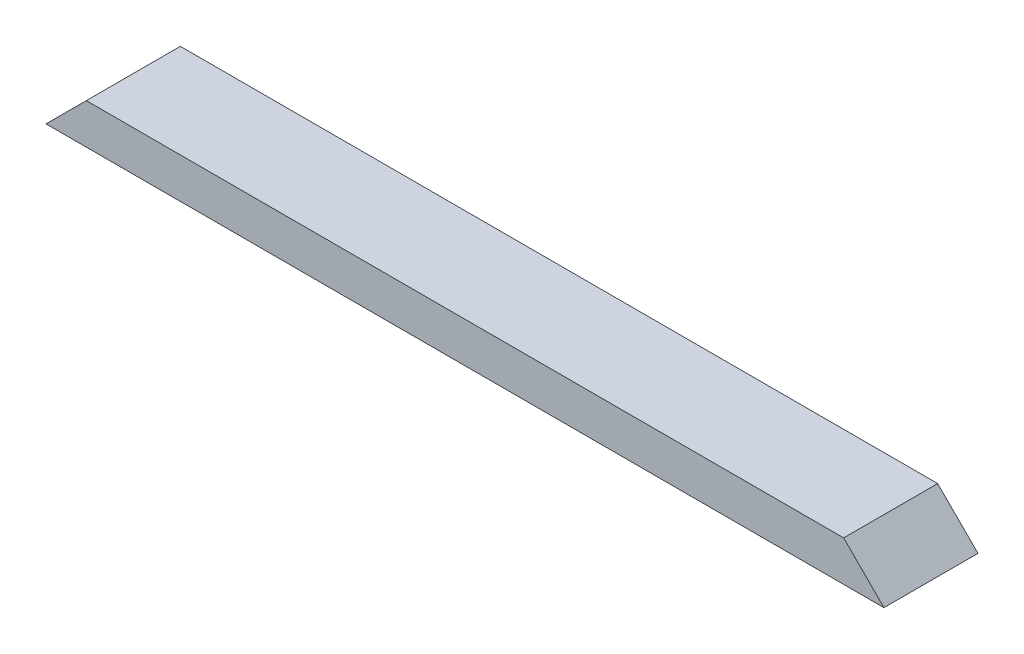
ISO-10303-21;
HEADER;
FILE_DESCRIPTION(('STEP AP214'),'2;1');
FILE_NAME('part.step','',(''),(''),'','','');
FILE_SCHEMA(('AUTOMOTIVE_DESIGN { 1 0 10303 214 1 1 1 1 }'));
ENDSEC;
DATA;
#1=APPLICATION_CONTEXT('core data for automotive mechanical design processes');
#2=APPLICATION_PROTOCOL_DEFINITION('international standard','automotive_design',2000,#1);
#3=PRODUCT_CONTEXT('',#1,'mechanical');
#4=PRODUCT('Part','Part','',(#3));
#5=PRODUCT_RELATED_PRODUCT_CATEGORY('part','',(#4));
#6=PRODUCT_DEFINITION_FORMATION('','',#4);
#7=PRODUCT_DEFINITION_CONTEXT('part definition',#1,'design');
#8=PRODUCT_DEFINITION('design','',#6,#7);
#9=PRODUCT_DEFINITION_SHAPE('','',#8);
#10=(LENGTH_UNIT() NAMED_UNIT(*) SI_UNIT(.MILLI.,.METRE.));
#11=(NAMED_UNIT(*) PLANE_ANGLE_UNIT() SI_UNIT($,.RADIAN.));
#12=(NAMED_UNIT(*) SI_UNIT($,.STERADIAN.) SOLID_ANGLE_UNIT());
#13=UNCERTAINTY_MEASURE_WITH_UNIT(LENGTH_MEASURE(1.E-05),#10,'distance_accuracy_value','');
#14=(GEOMETRIC_REPRESENTATION_CONTEXT(3) GLOBAL_UNCERTAINTY_ASSIGNED_CONTEXT((#13)) GLOBAL_UNIT_ASSIGNED_CONTEXT((#10,
#11,#12)) REPRESENTATION_CONTEXT('',''));
#15=CARTESIAN_POINT('',(0.,0.,0.));
#16=DIRECTION('',(0.,0.,1.));
#17=DIRECTION('',(1.,0.,0.));
#18=AXIS2_PLACEMENT_3D('',#15,#16,#17);
#19=CARTESIAN_POINT('',(0.,38.1,0.));
#20=DIRECTION('',(0.,0.,-1.));
#21=DIRECTION('',(-1.,0.,0.));
#22=AXIS2_PLACEMENT_3D('',#19,#20,#21);
#23=PLANE('',#22);
#24=DIRECTION('',(1.,0.,0.));
#25=VECTOR('',#24,1.);
#26=CARTESIAN_POINT('',(0.,38.1,0.));
#27=LINE('',#26,#25);
#28=CARTESIAN_POINT('',(38.1,38.1,0.));
#29=VERTEX_POINT('',#28);
#30=CARTESIAN_POINT('',(754.0752,38.1,0.));
#31=VERTEX_POINT('',#30);
#32=EDGE_CURVE('E51',#29,#31,#27,.T.);
#33=ORIENTED_EDGE('',*,*,#32,.F.);
#34=DIRECTION('',(0.707106781186547,0.707106781186547,0.));
#35=VECTOR('',#34,1.);
#36=CARTESIAN_POINT('',(0.,0.,0.));
#37=LINE('',#36,#35);
#38=CARTESIAN_POINT('',(0.,0.,0.));
#39=VERTEX_POINT('',#38);
#40=EDGE_CURVE('E86',#39,#29,#37,.T.);
#41=ORIENTED_EDGE('',*,*,#40,.F.);
#42=DIRECTION('',(1.,0.,0.));
#43=VECTOR('',#42,1.);
#44=CARTESIAN_POINT('',(0.,0.,0.));
#45=LINE('',#44,#43);
#46=CARTESIAN_POINT('',(792.1752,0.,0.));
#47=VERTEX_POINT('',#46);
#48=EDGE_CURVE('E92',#39,#47,#45,.T.);
#49=ORIENTED_EDGE('',*,*,#48,.T.);
#50=DIRECTION('',(0.707106781186548,-0.707106781186547,0.));
#51=VECTOR('',#50,1.);
#52=CARTESIAN_POINT('',(754.0752,38.1,0.));
#53=LINE('',#52,#51);
#54=EDGE_CURVE('E67',#31,#47,#53,.T.);
#55=ORIENTED_EDGE('',*,*,#54,.F.);
#56=EDGE_LOOP('',(#33,#41,#49,#55));
#57=FACE_BOUND('',#56,.T.);
#58=ADVANCED_FACE('F42',(#57),#23,.F.);
#59=CARTESIAN_POINT('',(0.,38.1,-88.9));
#60=DIRECTION('',(0.,0.,1.));
#61=DIRECTION('',(1.,0.,0.));
#62=AXIS2_PLACEMENT_3D('',#59,#60,#61);
#63=PLANE('',#62);
#64=DIRECTION('',(-1.,0.,0.));
#65=VECTOR('',#64,1.);
#66=CARTESIAN_POINT('',(0.,0.,-88.9));
#67=LINE('',#66,#65);
#68=CARTESIAN_POINT('',(792.1752,0.,-88.9));
#69=VERTEX_POINT('',#68);
#70=CARTESIAN_POINT('',(0.,0.,-88.9));
#71=VERTEX_POINT('',#70);
#72=EDGE_CURVE('E45',#69,#71,#67,.T.);
#73=ORIENTED_EDGE('',*,*,#72,.T.);
#74=DIRECTION('',(0.707106781186547,0.707106781186547,0.));
#75=VECTOR('',#74,1.);
#76=CARTESIAN_POINT('',(0.,0.,-88.9));
#77=LINE('',#76,#75);
#78=CARTESIAN_POINT('',(38.1,38.1,-88.9));
#79=VERTEX_POINT('',#78);
#80=EDGE_CURVE('E59',#71,#79,#77,.T.);
#81=ORIENTED_EDGE('',*,*,#80,.T.);
#82=DIRECTION('',(-1.,0.,0.));
#83=VECTOR('',#82,1.);
#84=CARTESIAN_POINT('',(0.,38.1,-88.9));
#85=LINE('',#84,#83);
#86=CARTESIAN_POINT('',(754.0752,38.1,-88.9));
#87=VERTEX_POINT('',#86);
#88=EDGE_CURVE('E11',#87,#79,#85,.T.);
#89=ORIENTED_EDGE('',*,*,#88,.F.);
#90=DIRECTION('',(0.707106781186548,-0.707106781186547,0.));
#91=VECTOR('',#90,1.);
#92=CARTESIAN_POINT('',(754.0752,38.1,-88.9));
#93=LINE('',#92,#91);
#94=EDGE_CURVE('E110',#87,#69,#93,.T.);
#95=ORIENTED_EDGE('',*,*,#94,.T.);
#96=EDGE_LOOP('',(#73,#81,#89,#95));
#97=FACE_BOUND('',#96,.T.);
#98=ADVANCED_FACE('F125',(#97),#63,.F.);
#99=CARTESIAN_POINT('',(0.,38.1,0.));
#100=DIRECTION('',(0.,-1.,0.));
#101=DIRECTION('',(0.,0.,-1.));
#102=AXIS2_PLACEMENT_3D('',#99,#100,#101);
#103=PLANE('',#102);
#104=ORIENTED_EDGE('',*,*,#88,.T.);
#105=DIRECTION('',(0.,0.,1.));
#106=VECTOR('',#105,1.);
#107=CARTESIAN_POINT('',(38.1,38.1,-88.9));
#108=LINE('',#107,#106);
#109=EDGE_CURVE('E93',#79,#29,#108,.T.);
#110=ORIENTED_EDGE('',*,*,#109,.T.);
#111=ORIENTED_EDGE('',*,*,#32,.T.);
#112=DIRECTION('',(0.,0.,1.));
#113=VECTOR('',#112,1.);
#114=CARTESIAN_POINT('',(754.0752,38.1,-88.9));
#115=LINE('',#114,#113);
#116=EDGE_CURVE('E114',#87,#31,#115,.T.);
#117=ORIENTED_EDGE('',*,*,#116,.F.);
#118=EDGE_LOOP('',(#104,#110,#111,#117));
#119=FACE_BOUND('',#118,.T.);
#120=ADVANCED_FACE('F128',(#119),#103,.F.);
#121=CARTESIAN_POINT('',(0.,0.,0.));
#122=DIRECTION('',(0.,-1.,0.));
#123=DIRECTION('',(0.,0.,-1.));
#124=AXIS2_PLACEMENT_3D('',#121,#122,#123);
#125=PLANE('',#124);
#126=DIRECTION('',(0.,0.,1.));
#127=VECTOR('',#126,1.);
#128=CARTESIAN_POINT('',(0.,0.,0.));
#129=LINE('',#128,#127);
#130=EDGE_CURVE('E83',#71,#39,#129,.T.);
#131=ORIENTED_EDGE('',*,*,#130,.F.);
#132=ORIENTED_EDGE('',*,*,#72,.F.);
#133=DIRECTION('',(0.,0.,-1.));
#134=VECTOR('',#133,1.);
#135=CARTESIAN_POINT('',(792.1752,0.,0.));
#136=LINE('',#135,#134);
#137=EDGE_CURVE('E102',#47,#69,#136,.T.);
#138=ORIENTED_EDGE('',*,*,#137,.F.);
#139=ORIENTED_EDGE('',*,*,#48,.F.);
#140=EDGE_LOOP('',(#131,#132,#138,#139));
#141=FACE_BOUND('',#140,.T.);
#142=ADVANCED_FACE('F101',(#141),#125,.T.);
#143=CARTESIAN_POINT('',(754.0752,38.1,-88.9));
#144=DIRECTION('',(-0.707106781186547,-0.707106781186548,0.));
#145=DIRECTION('',(0.707106781186548,-0.707106781186547,0.));
#146=AXIS2_PLACEMENT_3D('',#143,#144,#145);
#147=PLANE('',#146);
#148=ORIENTED_EDGE('',*,*,#54,.T.);
#149=ORIENTED_EDGE('',*,*,#137,.T.);
#150=ORIENTED_EDGE('',*,*,#94,.F.);
#151=ORIENTED_EDGE('',*,*,#116,.T.);
#152=EDGE_LOOP('',(#148,#149,#150,#151));
#153=FACE_BOUND('',#152,.T.);
#154=ADVANCED_FACE('F129',(#153),#147,.F.);
#155=CARTESIAN_POINT('',(0.,0.,-88.9));
#156=DIRECTION('',(0.707106781186547,-0.707106781186547,0.));
#157=DIRECTION('',(0.707106781186548,0.707106781186548,0.));
#158=AXIS2_PLACEMENT_3D('',#155,#156,#157);
#159=PLANE('',#158);
#160=ORIENTED_EDGE('',*,*,#40,.T.);
#161=ORIENTED_EDGE('',*,*,#109,.F.);
#162=ORIENTED_EDGE('',*,*,#80,.F.);
#163=ORIENTED_EDGE('',*,*,#130,.T.);
#164=EDGE_LOOP('',(#160,#161,#162,#163));
#165=FACE_BOUND('',#164,.T.);
#166=ADVANCED_FACE('F85',(#165),#159,.F.);
#167=CLOSED_SHELL('',(#58,#98,#120,#142,#154,#166));
#168=MANIFOLD_SOLID_BREP('B2',#167);
#169=ADVANCED_BREP_SHAPE_REPRESENTATION('',(#18,#168),#14);
#170=SHAPE_DEFINITION_REPRESENTATION(#9,#169);
ENDSEC;
END-ISO-10303-21;
